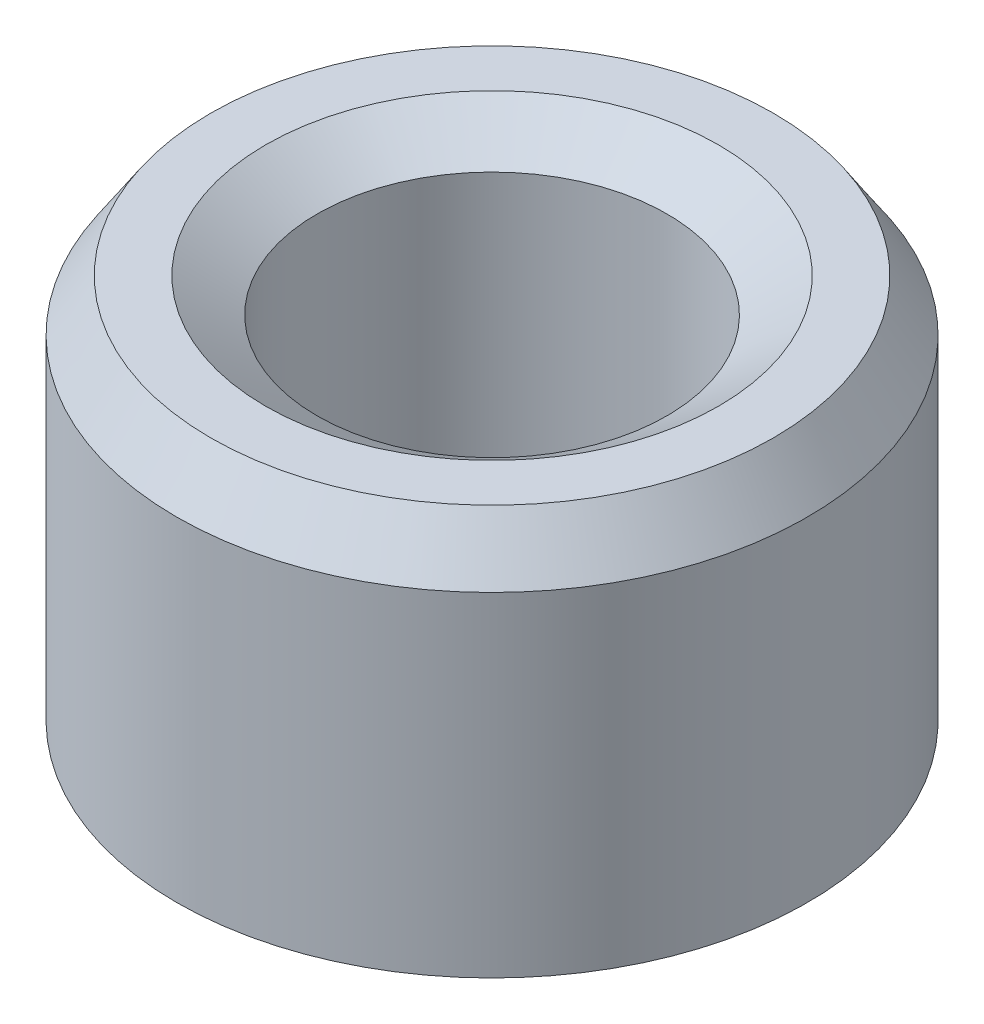
ISO-10303-21;
HEADER;
FILE_DESCRIPTION(('STEP AP214'),'2;1');
FILE_NAME('part.step','',(''),(''),'','','');
FILE_SCHEMA(('AUTOMOTIVE_DESIGN { 1 0 10303 214 1 1 1 1 }'));
ENDSEC;
DATA;
#1=APPLICATION_CONTEXT('core data for automotive mechanical design processes');
#2=APPLICATION_PROTOCOL_DEFINITION('international standard','automotive_design',2000,#1);
#3=PRODUCT_CONTEXT('',#1,'mechanical');
#4=PRODUCT('Part','Part','',(#3));
#5=PRODUCT_RELATED_PRODUCT_CATEGORY('part','',(#4));
#6=PRODUCT_DEFINITION_FORMATION('','',#4);
#7=PRODUCT_DEFINITION_CONTEXT('part definition',#1,'design');
#8=PRODUCT_DEFINITION('design','',#6,#7);
#9=PRODUCT_DEFINITION_SHAPE('','',#8);
#10=(LENGTH_UNIT() NAMED_UNIT(*) SI_UNIT(.MILLI.,.METRE.));
#11=(NAMED_UNIT(*) PLANE_ANGLE_UNIT() SI_UNIT($,.RADIAN.));
#12=(NAMED_UNIT(*) SI_UNIT($,.STERADIAN.) SOLID_ANGLE_UNIT());
#13=UNCERTAINTY_MEASURE_WITH_UNIT(LENGTH_MEASURE(1.E-05),#10,'distance_accuracy_value','');
#14=(GEOMETRIC_REPRESENTATION_CONTEXT(3) GLOBAL_UNCERTAINTY_ASSIGNED_CONTEXT((#13)) GLOBAL_UNIT_ASSIGNED_CONTEXT((#10,
#11,#12)) REPRESENTATION_CONTEXT('',''));
#15=CARTESIAN_POINT('',(0.,0.,0.));
#16=DIRECTION('',(0.,0.,1.));
#17=DIRECTION('',(1.,0.,0.));
#18=AXIS2_PLACEMENT_3D('',#15,#16,#17);
#19=CARTESIAN_POINT('',(0.,6.64955682655142,0.));
#20=DIRECTION('',(0.,-1.,0.));
#21=DIRECTION('',(0.,0.,-1.));
#22=AXIS2_PLACEMENT_3D('',#19,#20,#21);
#23=CYLINDRICAL_SURFACE('',#22,5.);
#24=CARTESIAN_POINT('',(0.,0.540330710748688,0.));
#25=DIRECTION('',(0.,1.,0.));
#26=DIRECTION('',(0.,0.,1.));
#27=AXIS2_PLACEMENT_3D('',#24,#25,#26);
#28=CIRCLE('',#27,5.);
#29=CARTESIAN_POINT('',(0.,0.540330710748688,5.));
#30=VERTEX_POINT('',#29);
#31=EDGE_CURVE('E10',#30,#30,#28,.T.);
#32=ORIENTED_EDGE('',*,*,#31,.T.);
#33=EDGE_LOOP('',(#32));
#34=FACE_BOUND('',#33,.T.);
#35=CARTESIAN_POINT('',(0.,5.833285272353,0.));
#36=DIRECTION('',(0.,1.,0.));
#37=DIRECTION('',(0.,0.,1.));
#38=AXIS2_PLACEMENT_3D('',#35,#36,#37);
#39=CIRCLE('',#38,5.);
#40=CARTESIAN_POINT('',(0.,5.833285272353,5.));
#41=VERTEX_POINT('',#40);
#42=EDGE_CURVE('E50',#41,#41,#39,.F.);
#43=ORIENTED_EDGE('',*,*,#42,.T.);
#44=EDGE_LOOP('',(#43));
#45=FACE_BOUND('',#44,.T.);
#46=ADVANCED_FACE('F39',(#34,#45),#23,.T.);
#47=CARTESIAN_POINT('',(0.,6.64955682655142,0.));
#48=DIRECTION('',(0.,1.,0.));
#49=DIRECTION('',(0.,0.,1.));
#50=AXIS2_PLACEMENT_3D('',#47,#48,#49);
#51=PLANE('',#50);
#52=CARTESIAN_POINT('',(0.,6.64955682655142,0.));
#53=DIRECTION('',(0.,1.,0.));
#54=DIRECTION('',(0.,0.,1.));
#55=AXIS2_PLACEMENT_3D('',#52,#53,#54);
#56=CIRCLE('',#55,3.58968767807485);
#57=CARTESIAN_POINT('',(0.,6.64955682655142,3.58968767807485));
#58=VERTEX_POINT('',#57);
#59=EDGE_CURVE('E58',#58,#58,#56,.F.);
#60=ORIENTED_EDGE('',*,*,#59,.T.);
#61=EDGE_LOOP('',(#60));
#62=FACE_BOUND('',#61,.T.);
#63=CARTESIAN_POINT('',(0.,6.64955682655142,0.));
#64=DIRECTION('',(0.,1.,0.));
#65=DIRECTION('',(0.,0.,1.));
#66=AXIS2_PLACEMENT_3D('',#63,#64,#65);
#67=CIRCLE('',#66,4.45966928925131);
#68=CARTESIAN_POINT('',(0.,6.64955682655142,4.45966928925131));
#69=VERTEX_POINT('',#68);
#70=EDGE_CURVE('E61',#69,#69,#67,.T.);
#71=ORIENTED_EDGE('',*,*,#70,.T.);
#72=EDGE_LOOP('',(#71));
#73=FACE_BOUND('',#72,.T.);
#74=ADVANCED_FACE('F88',(#62,#73),#51,.T.);
#75=CARTESIAN_POINT('',(0.,0.,0.));
#76=DIRECTION('',(0.,1.,0.));
#77=DIRECTION('',(0.,0.,1.));
#78=AXIS2_PLACEMENT_3D('',#75,#76,#77);
#79=PLANE('',#78);
#80=CARTESIAN_POINT('',(0.,0.,0.));
#81=DIRECTION('',(0.,1.,0.));
#82=DIRECTION('',(0.,0.,1.));
#83=AXIS2_PLACEMENT_3D('',#80,#81,#82);
#84=CIRCLE('',#83,3.31374683462511);
#85=CARTESIAN_POINT('',(0.,0.,3.31374683462511));
#86=VERTEX_POINT('',#85);
#87=EDGE_CURVE('E51',#86,#86,#84,.T.);
#88=ORIENTED_EDGE('',*,*,#87,.T.);
#89=EDGE_LOOP('',(#88));
#90=FACE_BOUND('',#89,.T.);
#91=CARTESIAN_POINT('',(0.,0.,0.));
#92=DIRECTION('',(0.,1.,0.));
#93=DIRECTION('',(0.,0.,1.));
#94=AXIS2_PLACEMENT_3D('',#91,#92,#93);
#95=CIRCLE('',#94,4.18372844580157);
#96=CARTESIAN_POINT('',(0.,0.,4.18372844580157));
#97=VERTEX_POINT('',#96);
#98=EDGE_CURVE('E54',#97,#97,#95,.F.);
#99=ORIENTED_EDGE('',*,*,#98,.T.);
#100=EDGE_LOOP('',(#99));
#101=FACE_BOUND('',#100,.T.);
#102=ADVANCED_FACE('F83',(#90,#101),#79,.F.);
#103=CARTESIAN_POINT('',(0.,6.64955682655142,0.));
#104=DIRECTION('',(0.,-1.,0.));
#105=DIRECTION('',(0.,0.,-1.));
#106=AXIS2_PLACEMENT_3D('',#103,#104,#105);
#107=CYLINDRICAL_SURFACE('',#106,2.77341612387642);
#108=CARTESIAN_POINT('',(0.,6.10922611580272,0.));
#109=DIRECTION('',(0.,1.,0.));
#110=DIRECTION('',(0.,0.,1.));
#111=AXIS2_PLACEMENT_3D('',#108,#109,#110);
#112=CIRCLE('',#111,2.77341612387642);
#113=CARTESIAN_POINT('',(0.,6.10922611580272,2.77341612387642));
#114=VERTEX_POINT('',#113);
#115=EDGE_CURVE('E67',#114,#114,#112,.T.);
#116=ORIENTED_EDGE('',*,*,#115,.T.);
#117=EDGE_LOOP('',(#116));
#118=FACE_BOUND('',#117,.T.);
#119=CARTESIAN_POINT('',(0.,0.816271554198425,0.));
#120=DIRECTION('',(0.,1.,0.));
#121=DIRECTION('',(0.,0.,1.));
#122=AXIS2_PLACEMENT_3D('',#119,#120,#121);
#123=CIRCLE('',#122,2.77341612387642);
#124=CARTESIAN_POINT('',(0.,0.816271554198425,2.77341612387642));
#125=VERTEX_POINT('',#124);
#126=EDGE_CURVE('E69',#125,#125,#123,.F.);
#127=ORIENTED_EDGE('',*,*,#126,.T.);
#128=EDGE_LOOP('',(#127));
#129=FACE_BOUND('',#128,.T.);
#130=ADVANCED_FACE('F71',(#118,#129),#107,.F.);
#131=CARTESIAN_POINT('',(0.,6.10922611580272,0.));
#132=DIRECTION('',(0.,1.,0.));
#133=DIRECTION('',(0.,0.,1.));
#134=AXIS2_PLACEMENT_3D('',#131,#132,#133);
#135=CONICAL_SURFACE('',#134,2.77341612387642,0.986066428497699);
#136=ORIENTED_EDGE('',*,*,#59,.F.);
#137=EDGE_LOOP('',(#136));
#138=FACE_BOUND('',#137,.T.);
#139=ORIENTED_EDGE('',*,*,#115,.F.);
#140=EDGE_LOOP('',(#139));
#141=FACE_BOUND('',#140,.T.);
#142=ADVANCED_FACE('F77',(#138,#141),#135,.F.);
#143=CARTESIAN_POINT('',(0.,0.,0.));
#144=DIRECTION('',(0.,-1.,0.));
#145=DIRECTION('',(0.,0.,-1.));
#146=AXIS2_PLACEMENT_3D('',#143,#144,#145);
#147=CONICAL_SURFACE('',#146,3.31374683462511,0.584729898297197);
#148=ORIENTED_EDGE('',*,*,#126,.F.);
#149=EDGE_LOOP('',(#148));
#150=FACE_BOUND('',#149,.T.);
#151=ORIENTED_EDGE('',*,*,#87,.F.);
#152=EDGE_LOOP('',(#151));
#153=FACE_BOUND('',#152,.T.);
#154=ADVANCED_FACE('F73',(#150,#153),#147,.F.);
#155=CARTESIAN_POINT('',(0.,0.540330710748688,0.));
#156=DIRECTION('',(0.,1.,0.));
#157=DIRECTION('',(0.,0.,1.));
#158=AXIS2_PLACEMENT_3D('',#155,#156,#157);
#159=CONICAL_SURFACE('',#158,5.,0.986066428497699);
#160=ORIENTED_EDGE('',*,*,#98,.F.);
#161=EDGE_LOOP('',(#160));
#162=FACE_BOUND('',#161,.T.);
#163=ORIENTED_EDGE('',*,*,#31,.F.);
#164=EDGE_LOOP('',(#163));
#165=FACE_BOUND('',#164,.T.);
#166=ADVANCED_FACE('F76',(#162,#165),#159,.T.);
#167=CARTESIAN_POINT('',(0.,6.64955682655142,0.));
#168=DIRECTION('',(0.,-1.,0.));
#169=DIRECTION('',(0.,0.,-1.));
#170=AXIS2_PLACEMENT_3D('',#167,#168,#169);
#171=CONICAL_SURFACE('',#170,4.45966928925131,0.584729898297199);
#172=ORIENTED_EDGE('',*,*,#42,.F.);
#173=EDGE_LOOP('',(#172));
#174=FACE_BOUND('',#173,.T.);
#175=ORIENTED_EDGE('',*,*,#70,.F.);
#176=EDGE_LOOP('',(#175));
#177=FACE_BOUND('',#176,.T.);
#178=ADVANCED_FACE('F45',(#174,#177),#171,.T.);
#179=CLOSED_SHELL('',(#46,#74,#102,#130,#142,#154,#166,#178));
#180=MANIFOLD_SOLID_BREP('B2',#179);
#181=ADVANCED_BREP_SHAPE_REPRESENTATION('',(#18,#180),#14);
#182=SHAPE_DEFINITION_REPRESENTATION(#9,#181);
ENDSEC;
END-ISO-10303-21;
